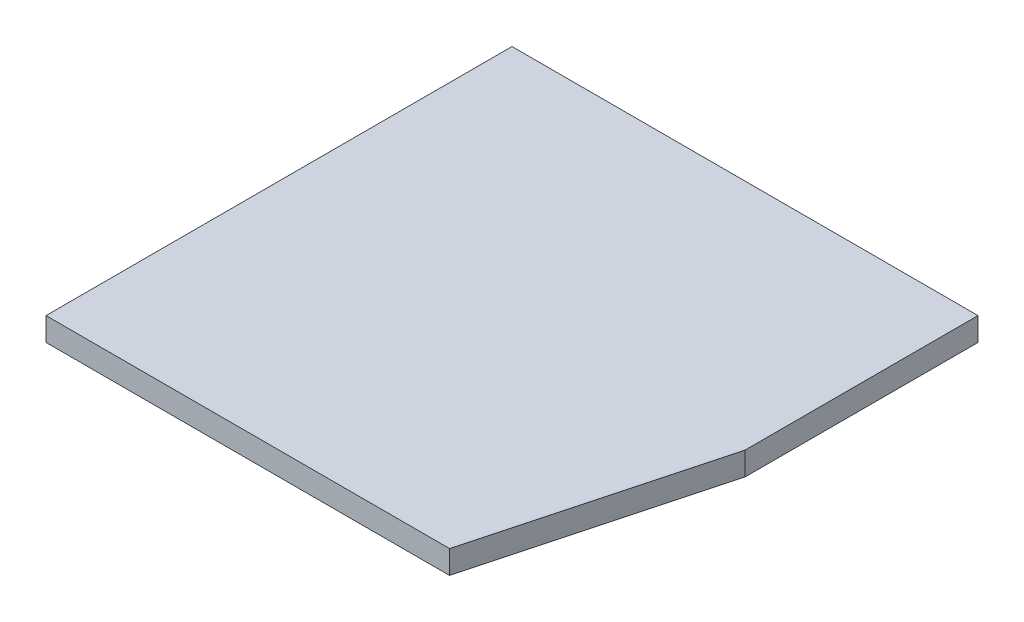
ISO-10303-21;
HEADER;
FILE_DESCRIPTION(('STEP AP214'),'2;1');
FILE_NAME('part.step','',(''),(''),'','','');
FILE_SCHEMA(('AUTOMOTIVE_DESIGN { 1 0 10303 214 1 1 1 1 }'));
ENDSEC;
DATA;
#1=APPLICATION_CONTEXT('core data for automotive mechanical design processes');
#2=APPLICATION_PROTOCOL_DEFINITION('international standard','automotive_design',2000,#1);
#3=PRODUCT_CONTEXT('',#1,'mechanical');
#4=PRODUCT('Part','Part','',(#3));
#5=PRODUCT_RELATED_PRODUCT_CATEGORY('part','',(#4));
#6=PRODUCT_DEFINITION_FORMATION('','',#4);
#7=PRODUCT_DEFINITION_CONTEXT('part definition',#1,'design');
#8=PRODUCT_DEFINITION('design','',#6,#7);
#9=PRODUCT_DEFINITION_SHAPE('','',#8);
#10=(LENGTH_UNIT() NAMED_UNIT(*) SI_UNIT(.MILLI.,.METRE.));
#11=(NAMED_UNIT(*) PLANE_ANGLE_UNIT() SI_UNIT($,.RADIAN.));
#12=(NAMED_UNIT(*) SI_UNIT($,.STERADIAN.) SOLID_ANGLE_UNIT());
#13=UNCERTAINTY_MEASURE_WITH_UNIT(LENGTH_MEASURE(1.E-05),#10,'distance_accuracy_value','');
#14=(GEOMETRIC_REPRESENTATION_CONTEXT(3) GLOBAL_UNCERTAINTY_ASSIGNED_CONTEXT((#13)) GLOBAL_UNIT_ASSIGNED_CONTEXT((#10,
#11,#12)) REPRESENTATION_CONTEXT('',''));
#15=CARTESIAN_POINT('',(0.,0.,0.));
#16=DIRECTION('',(0.,0.,1.));
#17=DIRECTION('',(1.,0.,0.));
#18=AXIS2_PLACEMENT_3D('',#15,#16,#17);
#19=CARTESIAN_POINT('',(-63.4999999999999,-3.175,127.));
#20=DIRECTION('',(0.,1.,0.));
#21=DIRECTION('',(0.,0.,1.));
#22=AXIS2_PLACEMENT_3D('',#19,#20,#21);
#23=PLANE('',#22);
#24=DIRECTION('',(0.258819045102515,0.,-0.96592582628907));
#25=VECTOR('',#24,1.);
#26=CARTESIAN_POINT('',(39.1176131403127,-3.175,154.496306570155));
#27=LINE('',#26,#25);
#28=CARTESIAN_POINT('',(46.4852262806243,-3.175,127.));
#29=VERTEX_POINT('',#28);
#30=CARTESIAN_POINT('',(63.5000000000002,-3.175006,63.5));
#31=VERTEX_POINT('',#30);
#32=EDGE_CURVE('E95',#29,#31,#27,.T.);
#33=ORIENTED_EDGE('',*,*,#32,.F.);
#34=DIRECTION('',(1.,0.,0.));
#35=VECTOR('',#34,1.);
#36=CARTESIAN_POINT('',(-63.4999999999999,-3.175,127.));
#37=LINE('',#36,#35);
#38=CARTESIAN_POINT('',(-63.4999999999999,-3.175,127.));
#39=VERTEX_POINT('',#38);
#40=EDGE_CURVE('E81',#39,#29,#37,.T.);
#41=ORIENTED_EDGE('',*,*,#40,.F.);
#42=DIRECTION('',(0.,0.,-1.));
#43=VECTOR('',#42,1.);
#44=CARTESIAN_POINT('',(-63.4999999999999,-3.175,127.));
#45=LINE('',#44,#43);
#46=CARTESIAN_POINT('',(-63.4999999999999,-3.175,0.));
#47=VERTEX_POINT('',#46);
#48=EDGE_CURVE('E11',#39,#47,#45,.T.);
#49=ORIENTED_EDGE('',*,*,#48,.T.);
#50=DIRECTION('',(1.,0.,0.));
#51=VECTOR('',#50,1.);
#52=CARTESIAN_POINT('',(-63.4999999999999,-3.175,0.));
#53=LINE('',#52,#51);
#54=CARTESIAN_POINT('',(63.5000000000002,-3.175,0.));
#55=VERTEX_POINT('',#54);
#56=EDGE_CURVE('E78',#47,#55,#53,.T.);
#57=ORIENTED_EDGE('',*,*,#56,.T.);
#58=DIRECTION('',(0.,0.,-1.));
#59=VECTOR('',#58,1.);
#60=CARTESIAN_POINT('',(63.5000000000002,-3.175,127.));
#61=LINE('',#60,#59);
#62=EDGE_CURVE('E37',#31,#55,#61,.T.);
#63=ORIENTED_EDGE('',*,*,#62,.F.);
#64=EDGE_LOOP('',(#33,#41,#49,#57,#63));
#65=FACE_BOUND('',#64,.T.);
#66=ADVANCED_FACE('F33',(#65),#23,.F.);
#67=CARTESIAN_POINT('',(63.5000000000002,-3.175,127.));
#68=DIRECTION('',(-1.,0.,0.));
#69=DIRECTION('',(0.,0.,1.));
#70=AXIS2_PLACEMENT_3D('',#67,#68,#69);
#71=PLANE('',#70);
#72=DIRECTION('',(0.,-1.,0.));
#73=VECTOR('',#72,1.);
#74=CARTESIAN_POINT('',(63.5000000000002,3.175,63.5));
#75=LINE('',#74,#73);
#76=CARTESIAN_POINT('',(63.5000000000002,3.175,63.5));
#77=VERTEX_POINT('',#76);
#78=EDGE_CURVE('E118',#77,#31,#75,.T.);
#79=ORIENTED_EDGE('',*,*,#78,.T.);
#80=ORIENTED_EDGE('',*,*,#62,.T.);
#81=DIRECTION('',(0.,1.,0.));
#82=VECTOR('',#81,1.);
#83=CARTESIAN_POINT('',(63.5000000000002,-3.175,0.));
#84=LINE('',#83,#82);
#85=CARTESIAN_POINT('',(63.5000000000002,3.175,0.));
#86=VERTEX_POINT('',#85);
#87=EDGE_CURVE('E89',#55,#86,#84,.T.);
#88=ORIENTED_EDGE('',*,*,#87,.T.);
#89=DIRECTION('',(0.,0.,-1.));
#90=VECTOR('',#89,1.);
#91=CARTESIAN_POINT('',(63.5000000000002,3.175,127.));
#92=LINE('',#91,#90);
#93=EDGE_CURVE('E106',#77,#86,#92,.T.);
#94=ORIENTED_EDGE('',*,*,#93,.F.);
#95=EDGE_LOOP('',(#79,#80,#88,#94));
#96=FACE_BOUND('',#95,.T.);
#97=ADVANCED_FACE('F127',(#96),#71,.F.);
#98=CARTESIAN_POINT('',(-63.4999999999999,3.175,127.));
#99=DIRECTION('',(0.,1.,0.));
#100=DIRECTION('',(0.,0.,1.));
#101=AXIS2_PLACEMENT_3D('',#98,#99,#100);
#102=PLANE('',#101);
#103=DIRECTION('',(1.,0.,0.));
#104=VECTOR('',#103,1.);
#105=CARTESIAN_POINT('',(-63.4999999999999,3.175,127.));
#106=LINE('',#105,#104);
#107=CARTESIAN_POINT('',(-63.4999999999999,3.175,127.));
#108=VERTEX_POINT('',#107);
#109=CARTESIAN_POINT('',(46.4852262806243,3.175,127.));
#110=VERTEX_POINT('',#109);
#111=EDGE_CURVE('E107',#108,#110,#106,.T.);
#112=ORIENTED_EDGE('',*,*,#111,.T.);
#113=DIRECTION('',(-0.258819045102515,0.,0.96592582628907));
#114=VECTOR('',#113,1.);
#115=CARTESIAN_POINT('',(63.5000000000002,3.175,63.5));
#116=LINE('',#115,#114);
#117=EDGE_CURVE('E50',#77,#110,#116,.T.);
#118=ORIENTED_EDGE('',*,*,#117,.F.);
#119=ORIENTED_EDGE('',*,*,#93,.T.);
#120=DIRECTION('',(1.,0.,0.));
#121=VECTOR('',#120,1.);
#122=CARTESIAN_POINT('',(-63.4999999999999,3.175,0.));
#123=LINE('',#122,#121);
#124=CARTESIAN_POINT('',(-63.4999999999999,3.175,0.));
#125=VERTEX_POINT('',#124);
#126=EDGE_CURVE('E94',#125,#86,#123,.T.);
#127=ORIENTED_EDGE('',*,*,#126,.F.);
#128=DIRECTION('',(0.,0.,-1.));
#129=VECTOR('',#128,1.);
#130=CARTESIAN_POINT('',(-63.4999999999999,3.175,127.));
#131=LINE('',#130,#129);
#132=EDGE_CURVE('E92',#108,#125,#131,.T.);
#133=ORIENTED_EDGE('',*,*,#132,.F.);
#134=EDGE_LOOP('',(#112,#118,#119,#127,#133));
#135=FACE_BOUND('',#134,.T.);
#136=ADVANCED_FACE('F130',(#135),#102,.T.);
#137=CARTESIAN_POINT('',(0.,0.,127.));
#138=DIRECTION('',(0.,0.,-1.));
#139=DIRECTION('',(-1.,0.,0.));
#140=AXIS2_PLACEMENT_3D('',#137,#138,#139);
#141=PLANE('',#140);
#142=DIRECTION('',(0.,-1.,0.));
#143=VECTOR('',#142,1.);
#144=CARTESIAN_POINT('',(46.4852262806243,3.175,127.));
#145=LINE('',#144,#143);
#146=EDGE_CURVE('E99',#110,#29,#145,.T.);
#147=ORIENTED_EDGE('',*,*,#146,.F.);
#148=ORIENTED_EDGE('',*,*,#111,.F.);
#149=DIRECTION('',(0.,1.,0.));
#150=VECTOR('',#149,1.);
#151=CARTESIAN_POINT('',(-63.4999999999999,-3.175,127.));
#152=LINE('',#151,#150);
#153=EDGE_CURVE('E90',#39,#108,#152,.T.);
#154=ORIENTED_EDGE('',*,*,#153,.F.);
#155=ORIENTED_EDGE('',*,*,#40,.T.);
#156=EDGE_LOOP('',(#147,#148,#154,#155));
#157=FACE_BOUND('',#156,.T.);
#158=ADVANCED_FACE('F131',(#157),#141,.F.);
#159=CARTESIAN_POINT('',(-63.4999999999999,-3.175,127.));
#160=DIRECTION('',(-1.,0.,0.));
#161=DIRECTION('',(0.,0.,1.));
#162=AXIS2_PLACEMENT_3D('',#159,#160,#161);
#163=PLANE('',#162);
#164=DIRECTION('',(0.,1.,0.));
#165=VECTOR('',#164,1.);
#166=CARTESIAN_POINT('',(-63.4999999999999,-3.175,0.));
#167=LINE('',#166,#165);
#168=EDGE_CURVE('E87',#47,#125,#167,.T.);
#169=ORIENTED_EDGE('',*,*,#168,.F.);
#170=ORIENTED_EDGE('',*,*,#48,.F.);
#171=ORIENTED_EDGE('',*,*,#153,.T.);
#172=ORIENTED_EDGE('',*,*,#132,.T.);
#173=EDGE_LOOP('',(#169,#170,#171,#172));
#174=FACE_BOUND('',#173,.T.);
#175=ADVANCED_FACE('F35',(#174),#163,.T.);
#176=CARTESIAN_POINT('',(0.,0.,0.));
#177=DIRECTION('',(0.,0.,-1.));
#178=DIRECTION('',(-1.,0.,0.));
#179=AXIS2_PLACEMENT_3D('',#176,#177,#178);
#180=PLANE('',#179);
#181=ORIENTED_EDGE('',*,*,#168,.T.);
#182=ORIENTED_EDGE('',*,*,#126,.T.);
#183=ORIENTED_EDGE('',*,*,#87,.F.);
#184=ORIENTED_EDGE('',*,*,#56,.F.);
#185=EDGE_LOOP('',(#181,#182,#183,#184));
#186=FACE_BOUND('',#185,.T.);
#187=ADVANCED_FACE('F85',(#186),#180,.T.);
#188=CARTESIAN_POINT('',(63.5000000000002,3.175,63.5));
#189=DIRECTION('',(0.96592582628907,0.,0.258819045102515));
#190=DIRECTION('',(0.258819045102515,0.,-0.96592582628907));
#191=AXIS2_PLACEMENT_3D('',#188,#189,#190);
#192=PLANE('',#191);
#193=ORIENTED_EDGE('',*,*,#32,.T.);
#194=ORIENTED_EDGE('',*,*,#78,.F.);
#195=ORIENTED_EDGE('',*,*,#117,.T.);
#196=ORIENTED_EDGE('',*,*,#146,.T.);
#197=EDGE_LOOP('',(#193,#194,#195,#196));
#198=FACE_BOUND('',#197,.T.);
#199=ADVANCED_FACE('F122',(#198),#192,.T.);
#200=CLOSED_SHELL('',(#66,#97,#136,#158,#175,#187,#199));
#201=MANIFOLD_SOLID_BREP('B2',#200);
#202=ADVANCED_BREP_SHAPE_REPRESENTATION('',(#18,#201),#14);
#203=SHAPE_DEFINITION_REPRESENTATION(#9,#202);
ENDSEC;
END-ISO-10303-21;
